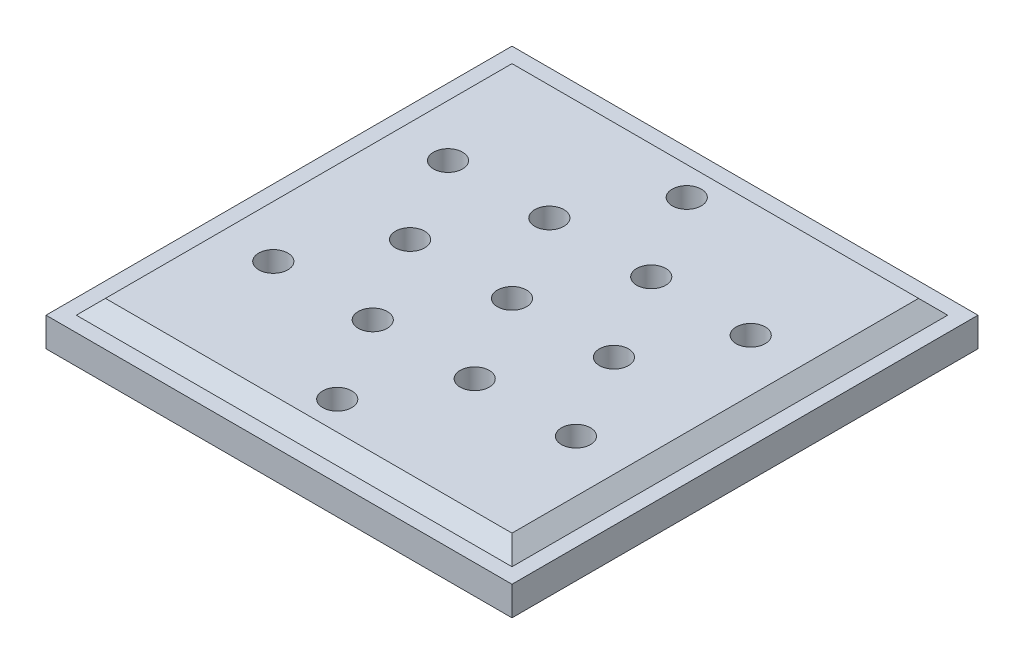
ISO-10303-21;
HEADER;
FILE_DESCRIPTION(('STEP AP214'),'2;1');
FILE_NAME('part.step','',(''),(''),'','','');
FILE_SCHEMA(('AUTOMOTIVE_DESIGN { 1 0 10303 214 1 1 1 1 }'));
ENDSEC;
DATA;
#1=APPLICATION_CONTEXT('core data for automotive mechanical design processes');
#2=APPLICATION_PROTOCOL_DEFINITION('international standard','automotive_design',2000,#1);
#3=PRODUCT_CONTEXT('',#1,'mechanical');
#4=PRODUCT('Part','Part','',(#3));
#5=PRODUCT_RELATED_PRODUCT_CATEGORY('part','',(#4));
#6=PRODUCT_DEFINITION_FORMATION('','',#4);
#7=PRODUCT_DEFINITION_CONTEXT('part definition',#1,'design');
#8=PRODUCT_DEFINITION('design','',#6,#7);
#9=PRODUCT_DEFINITION_SHAPE('','',#8);
#10=(LENGTH_UNIT() NAMED_UNIT(*) SI_UNIT(.MILLI.,.METRE.));
#11=(NAMED_UNIT(*) PLANE_ANGLE_UNIT() SI_UNIT($,.RADIAN.));
#12=(NAMED_UNIT(*) SI_UNIT($,.STERADIAN.) SOLID_ANGLE_UNIT());
#13=UNCERTAINTY_MEASURE_WITH_UNIT(LENGTH_MEASURE(1.E-05),#10,'distance_accuracy_value','');
#14=(GEOMETRIC_REPRESENTATION_CONTEXT(3) GLOBAL_UNCERTAINTY_ASSIGNED_CONTEXT((#13)) GLOBAL_UNIT_ASSIGNED_CONTEXT((#10,
#11,#12)) REPRESENTATION_CONTEXT('',''));
#15=CARTESIAN_POINT('',(0.,0.,0.));
#16=DIRECTION('',(0.,0.,1.));
#17=DIRECTION('',(1.,0.,0.));
#18=AXIS2_PLACEMENT_3D('',#15,#16,#17);
#19=CARTESIAN_POINT('',(50.8,9.525,-50.8));
#20=DIRECTION('',(-1.,0.,0.));
#21=DIRECTION('',(0.,0.,1.));
#22=AXIS2_PLACEMENT_3D('',#19,#20,#21);
#23=PLANE('',#22);
#24=DIRECTION('',(0.,0.,-1.));
#25=VECTOR('',#24,1.);
#26=CARTESIAN_POINT('',(50.8,6.35,-50.8));
#27=LINE('',#26,#25);
#28=CARTESIAN_POINT('',(50.8,6.35,50.8));
#29=VERTEX_POINT('',#28);
#30=CARTESIAN_POINT('',(50.8,6.35,-50.8));
#31=VERTEX_POINT('',#30);
#32=EDGE_CURVE('E141',#29,#31,#27,.T.);
#33=ORIENTED_EDGE('',*,*,#32,.F.);
#34=DIRECTION('',(0.,-1.,0.));
#35=VECTOR('',#34,1.);
#36=CARTESIAN_POINT('',(50.8,9.525,50.8));
#37=LINE('',#36,#35);
#38=CARTESIAN_POINT('',(50.8,0.,50.8));
#39=VERTEX_POINT('',#38);
#40=EDGE_CURVE('E155',#29,#39,#37,.T.);
#41=ORIENTED_EDGE('',*,*,#40,.T.);
#42=DIRECTION('',(0.,0.,-1.));
#43=VECTOR('',#42,1.);
#44=CARTESIAN_POINT('',(50.8,0.,-50.8));
#45=LINE('',#44,#43);
#46=CARTESIAN_POINT('',(50.8,0.,-50.8));
#47=VERTEX_POINT('',#46);
#48=EDGE_CURVE('E143',#39,#47,#45,.T.);
#49=ORIENTED_EDGE('',*,*,#48,.T.);
#50=DIRECTION('',(0.,-1.,0.));
#51=VECTOR('',#50,1.);
#52=CARTESIAN_POINT('',(50.8,9.525,-50.8));
#53=LINE('',#52,#51);
#54=EDGE_CURVE('E161',#31,#47,#53,.T.);
#55=ORIENTED_EDGE('',*,*,#54,.F.);
#56=EDGE_LOOP('',(#33,#41,#49,#55));
#57=FACE_BOUND('',#56,.T.);
#58=ADVANCED_FACE('F34',(#57),#23,.F.);
#59=CARTESIAN_POINT('',(-50.8,9.525,-50.8));
#60=DIRECTION('',(0.,0.,1.));
#61=DIRECTION('',(1.,0.,0.));
#62=AXIS2_PLACEMENT_3D('',#59,#60,#61);
#63=PLANE('',#62);
#64=DIRECTION('',(-1.,0.,0.));
#65=VECTOR('',#64,1.);
#66=CARTESIAN_POINT('',(-50.8,6.35,-50.8));
#67=LINE('',#66,#65);
#68=CARTESIAN_POINT('',(-50.8,6.35,-50.8));
#69=VERTEX_POINT('',#68);
#70=EDGE_CURVE('E139',#31,#69,#67,.T.);
#71=ORIENTED_EDGE('',*,*,#70,.F.);
#72=ORIENTED_EDGE('',*,*,#54,.T.);
#73=DIRECTION('',(-1.,0.,0.));
#74=VECTOR('',#73,1.);
#75=CARTESIAN_POINT('',(-50.8,0.,-50.8));
#76=LINE('',#75,#74);
#77=CARTESIAN_POINT('',(-50.8,0.,-50.8));
#78=VERTEX_POINT('',#77);
#79=EDGE_CURVE('E146',#47,#78,#76,.T.);
#80=ORIENTED_EDGE('',*,*,#79,.T.);
#81=DIRECTION('',(0.,-1.,0.));
#82=VECTOR('',#81,1.);
#83=CARTESIAN_POINT('',(-50.8,9.525,-50.8));
#84=LINE('',#83,#82);
#85=EDGE_CURVE('E159',#69,#78,#84,.T.);
#86=ORIENTED_EDGE('',*,*,#85,.F.);
#87=EDGE_LOOP('',(#71,#72,#80,#86));
#88=FACE_BOUND('',#87,.T.);
#89=ADVANCED_FACE('F182',(#88),#63,.F.);
#90=CARTESIAN_POINT('',(-50.8,9.525,-50.8));
#91=DIRECTION('',(1.,0.,0.));
#92=DIRECTION('',(0.,0.,-1.));
#93=AXIS2_PLACEMENT_3D('',#90,#91,#92);
#94=PLANE('',#93);
#95=DIRECTION('',(0.,0.,1.));
#96=VECTOR('',#95,1.);
#97=CARTESIAN_POINT('',(-50.8,6.35,-50.8));
#98=LINE('',#97,#96);
#99=CARTESIAN_POINT('',(-50.8,6.35,50.8));
#100=VERTEX_POINT('',#99);
#101=EDGE_CURVE('E135',#69,#100,#98,.T.);
#102=ORIENTED_EDGE('',*,*,#101,.F.);
#103=ORIENTED_EDGE('',*,*,#85,.T.);
#104=DIRECTION('',(0.,0.,1.));
#105=VECTOR('',#104,1.);
#106=CARTESIAN_POINT('',(-50.8,0.,-50.8));
#107=LINE('',#106,#105);
#108=CARTESIAN_POINT('',(-50.8,0.,50.8));
#109=VERTEX_POINT('',#108);
#110=EDGE_CURVE('E149',#78,#109,#107,.T.);
#111=ORIENTED_EDGE('',*,*,#110,.T.);
#112=DIRECTION('',(0.,-1.,0.));
#113=VECTOR('',#112,1.);
#114=CARTESIAN_POINT('',(-50.8,9.525,50.8));
#115=LINE('',#114,#113);
#116=EDGE_CURVE('E157',#100,#109,#115,.T.);
#117=ORIENTED_EDGE('',*,*,#116,.F.);
#118=EDGE_LOOP('',(#102,#103,#111,#117));
#119=FACE_BOUND('',#118,.T.);
#120=ADVANCED_FACE('F188',(#119),#94,.F.);
#121=CARTESIAN_POINT('',(-50.8,9.525,50.8));
#122=DIRECTION('',(0.,0.,-1.));
#123=DIRECTION('',(-1.,0.,0.));
#124=AXIS2_PLACEMENT_3D('',#121,#122,#123);
#125=PLANE('',#124);
#126=DIRECTION('',(1.,0.,0.));
#127=VECTOR('',#126,1.);
#128=CARTESIAN_POINT('',(-50.8,6.35,50.8));
#129=LINE('',#128,#127);
#130=EDGE_CURVE('E163',#100,#29,#129,.T.);
#131=ORIENTED_EDGE('',*,*,#130,.F.);
#132=ORIENTED_EDGE('',*,*,#116,.T.);
#133=DIRECTION('',(1.,0.,0.));
#134=VECTOR('',#133,1.);
#135=CARTESIAN_POINT('',(-50.8,0.,50.8));
#136=LINE('',#135,#134);
#137=EDGE_CURVE('E152',#109,#39,#136,.T.);
#138=ORIENTED_EDGE('',*,*,#137,.T.);
#139=ORIENTED_EDGE('',*,*,#40,.F.);
#140=EDGE_LOOP('',(#131,#132,#138,#139));
#141=FACE_BOUND('',#140,.T.);
#142=ADVANCED_FACE('F372',(#141),#125,.F.);
#143=CARTESIAN_POINT('',(0.,0.,0.));
#144=DIRECTION('',(0.,1.,0.));
#145=DIRECTION('',(0.,0.,1.));
#146=AXIS2_PLACEMENT_3D('',#143,#144,#145);
#147=PLANE('',#146);
#148=CARTESIAN_POINT('',(11.1125,0.,-19.2474145991092));
#149=DIRECTION('',(0.,1.,0.));
#150=DIRECTION('',(0.,0.,1.));
#151=AXIS2_PLACEMENT_3D('',#148,#149,#150);
#152=CIRCLE('',#151,3.175);
#153=CARTESIAN_POINT('',(11.1125,0.,-16.0724145991092));
#154=VERTEX_POINT('',#153);
#155=EDGE_CURVE('E399',#154,#154,#152,.F.);
#156=ORIENTED_EDGE('',*,*,#155,.F.);
#157=EDGE_LOOP('',(#156));
#158=FACE_BOUND('',#157,.T.);
#159=CARTESIAN_POINT('',(-11.1125,0.,-19.2474145991091));
#160=DIRECTION('',(0.,1.,0.));
#161=DIRECTION('',(0.,0.,1.));
#162=AXIS2_PLACEMENT_3D('',#159,#160,#161);
#163=CIRCLE('',#162,3.175);
#164=CARTESIAN_POINT('',(-11.1125,0.,-16.0724145991091));
#165=VERTEX_POINT('',#164);
#166=EDGE_CURVE('E403',#165,#165,#163,.F.);
#167=ORIENTED_EDGE('',*,*,#166,.F.);
#168=EDGE_LOOP('',(#167));
#169=FACE_BOUND('',#168,.T.);
#170=CARTESIAN_POINT('',(-22.225,0.,0.));
#171=DIRECTION('',(0.,1.,0.));
#172=DIRECTION('',(0.,0.,1.));
#173=AXIS2_PLACEMENT_3D('',#170,#171,#172);
#174=CIRCLE('',#173,3.175);
#175=CARTESIAN_POINT('',(-22.225,0.,3.175));
#176=VERTEX_POINT('',#175);
#177=EDGE_CURVE('E407',#176,#176,#174,.F.);
#178=ORIENTED_EDGE('',*,*,#177,.F.);
#179=EDGE_LOOP('',(#178));
#180=FACE_BOUND('',#179,.T.);
#181=CARTESIAN_POINT('',(-11.1125,0.,19.2474145991092));
#182=DIRECTION('',(0.,1.,0.));
#183=DIRECTION('',(0.,0.,1.));
#184=AXIS2_PLACEMENT_3D('',#181,#182,#183);
#185=CIRCLE('',#184,3.175);
#186=CARTESIAN_POINT('',(-11.1125,0.,22.4224145991092));
#187=VERTEX_POINT('',#186);
#188=EDGE_CURVE('E411',#187,#187,#185,.F.);
#189=ORIENTED_EDGE('',*,*,#188,.F.);
#190=EDGE_LOOP('',(#189));
#191=FACE_BOUND('',#190,.T.);
#192=CARTESIAN_POINT('',(11.1125,0.,19.2474145991092));
#193=DIRECTION('',(0.,1.,0.));
#194=DIRECTION('',(0.,0.,1.));
#195=AXIS2_PLACEMENT_3D('',#192,#193,#194);
#196=CIRCLE('',#195,3.175);
#197=CARTESIAN_POINT('',(11.1125,0.,22.4224145991092));
#198=VERTEX_POINT('',#197);
#199=EDGE_CURVE('E415',#198,#198,#196,.F.);
#200=ORIENTED_EDGE('',*,*,#199,.F.);
#201=EDGE_LOOP('',(#200));
#202=FACE_BOUND('',#201,.T.);
#203=CARTESIAN_POINT('',(0.,0.,0.));
#204=DIRECTION('',(0.,1.,0.));
#205=DIRECTION('',(0.,0.,1.));
#206=AXIS2_PLACEMENT_3D('',#203,#204,#205);
#207=CIRCLE('',#206,3.175);
#208=CARTESIAN_POINT('',(0.,0.,3.17500000000001));
#209=VERTEX_POINT('',#208);
#210=EDGE_CURVE('E419',#209,#209,#207,.F.);
#211=ORIENTED_EDGE('',*,*,#210,.F.);
#212=EDGE_LOOP('',(#211));
#213=FACE_BOUND('',#212,.T.);
#214=CARTESIAN_POINT('',(-32.9955678841871,0.,-19.05));
#215=DIRECTION('',(0.,1.,0.));
#216=DIRECTION('',(0.,0.,1.));
#217=AXIS2_PLACEMENT_3D('',#214,#215,#216);
#218=CIRCLE('',#217,3.17500000000044);
#219=CARTESIAN_POINT('',(-32.9955678841871,0.,-15.8749999999996));
#220=VERTEX_POINT('',#219);
#221=EDGE_CURVE('E423',#220,#220,#218,.F.);
#222=ORIENTED_EDGE('',*,*,#221,.F.);
#223=EDGE_LOOP('',(#222));
#224=FACE_BOUND('',#223,.T.);
#225=CARTESIAN_POINT('',(-32.9955678841871,0.,19.05));
#226=DIRECTION('',(0.,1.,0.));
#227=DIRECTION('',(0.,0.,1.));
#228=AXIS2_PLACEMENT_3D('',#225,#226,#227);
#229=CIRCLE('',#228,3.17500000000033);
#230=CARTESIAN_POINT('',(-32.9955678841871,0.,22.2250000000003));
#231=VERTEX_POINT('',#230);
#232=EDGE_CURVE('E427',#231,#231,#229,.F.);
#233=ORIENTED_EDGE('',*,*,#232,.F.);
#234=EDGE_LOOP('',(#233));
#235=FACE_BOUND('',#234,.T.);
#236=CARTESIAN_POINT('',(0.,0.,38.1));
#237=DIRECTION('',(0.,1.,0.));
#238=DIRECTION('',(0.,0.,1.));
#239=AXIS2_PLACEMENT_3D('',#236,#237,#238);
#240=CIRCLE('',#239,3.17500000000023);
#241=CARTESIAN_POINT('',(0.,0.,41.2750000000002));
#242=VERTEX_POINT('',#241);
#243=EDGE_CURVE('E431',#242,#242,#240,.F.);
#244=ORIENTED_EDGE('',*,*,#243,.F.);
#245=EDGE_LOOP('',(#244));
#246=FACE_BOUND('',#245,.T.);
#247=CARTESIAN_POINT('',(32.9955678841871,0.,19.05));
#248=DIRECTION('',(0.,1.,0.));
#249=DIRECTION('',(0.,0.,1.));
#250=AXIS2_PLACEMENT_3D('',#247,#248,#249);
#251=CIRCLE('',#250,3.17500000000017);
#252=CARTESIAN_POINT('',(32.9955678841871,0.,22.2250000000002));
#253=VERTEX_POINT('',#252);
#254=EDGE_CURVE('E435',#253,#253,#251,.F.);
#255=ORIENTED_EDGE('',*,*,#254,.F.);
#256=EDGE_LOOP('',(#255));
#257=FACE_BOUND('',#256,.T.);
#258=CARTESIAN_POINT('',(32.9955678841871,0.,-19.05));
#259=DIRECTION('',(0.,1.,0.));
#260=DIRECTION('',(0.,0.,1.));
#261=AXIS2_PLACEMENT_3D('',#258,#259,#260);
#262=CIRCLE('',#261,3.17500000000009);
#263=CARTESIAN_POINT('',(32.9955678841871,0.,-15.8749999999999));
#264=VERTEX_POINT('',#263);
#265=EDGE_CURVE('E439',#264,#264,#262,.F.);
#266=ORIENTED_EDGE('',*,*,#265,.F.);
#267=EDGE_LOOP('',(#266));
#268=FACE_BOUND('',#267,.T.);
#269=CARTESIAN_POINT('',(22.225,0.,0.));
#270=DIRECTION('',(0.,1.,0.));
#271=DIRECTION('',(0.,0.,1.));
#272=AXIS2_PLACEMENT_3D('',#269,#270,#271);
#273=CIRCLE('',#272,3.175);
#274=CARTESIAN_POINT('',(22.225,0.,3.17500000000001));
#275=VERTEX_POINT('',#274);
#276=EDGE_CURVE('E443',#275,#275,#273,.F.);
#277=ORIENTED_EDGE('',*,*,#276,.F.);
#278=EDGE_LOOP('',(#277));
#279=FACE_BOUND('',#278,.T.);
#280=CARTESIAN_POINT('',(0.,0.,-38.1));
#281=DIRECTION('',(0.,1.,0.));
#282=DIRECTION('',(0.,0.,1.));
#283=AXIS2_PLACEMENT_3D('',#280,#281,#282);
#284=CIRCLE('',#283,3.175);
#285=CARTESIAN_POINT('',(0.,0.,-34.925));
#286=VERTEX_POINT('',#285);
#287=EDGE_CURVE('E117',#286,#286,#284,.F.);
#288=ORIENTED_EDGE('',*,*,#287,.F.);
#289=EDGE_LOOP('',(#288));
#290=FACE_BOUND('',#289,.T.);
#291=ORIENTED_EDGE('',*,*,#48,.F.);
#292=ORIENTED_EDGE('',*,*,#137,.F.);
#293=ORIENTED_EDGE('',*,*,#110,.F.);
#294=ORIENTED_EDGE('',*,*,#79,.F.);
#295=EDGE_LOOP('',(#291,#292,#293,#294));
#296=FACE_BOUND('',#295,.T.);
#297=ADVANCED_FACE('F176',(#158,#169,#180,#191,#202,#213,#224,#235,#246,#257,#268,#279,#290,
#296),#147,.F.);
#298=CARTESIAN_POINT('',(0.,6.35,0.));
#299=DIRECTION('',(0.,1.,0.));
#300=DIRECTION('',(0.,0.,1.));
#301=AXIS2_PLACEMENT_3D('',#298,#299,#300);
#302=PLANE('',#301);
#303=DIRECTION('',(1.,0.,0.));
#304=VECTOR('',#303,1.);
#305=CARTESIAN_POINT('',(-47.498,6.35,47.498));
#306=LINE('',#305,#304);
#307=CARTESIAN_POINT('',(-47.498,6.35,47.498));
#308=VERTEX_POINT('',#307);
#309=CARTESIAN_POINT('',(47.498,6.35,47.498));
#310=VERTEX_POINT('',#309);
#311=EDGE_CURVE('E130',#308,#310,#306,.T.);
#312=ORIENTED_EDGE('',*,*,#311,.F.);
#313=DIRECTION('',(0.,0.,1.));
#314=VECTOR('',#313,1.);
#315=CARTESIAN_POINT('',(-47.498,6.35,-47.498));
#316=LINE('',#315,#314);
#317=CARTESIAN_POINT('',(-47.498,6.35,-47.498));
#318=VERTEX_POINT('',#317);
#319=EDGE_CURVE('E106',#318,#308,#316,.T.);
#320=ORIENTED_EDGE('',*,*,#319,.F.);
#321=DIRECTION('',(-1.,0.,0.));
#322=VECTOR('',#321,1.);
#323=CARTESIAN_POINT('',(-47.498,6.35,-47.498));
#324=LINE('',#323,#322);
#325=CARTESIAN_POINT('',(47.498,6.35,-47.498));
#326=VERTEX_POINT('',#325);
#327=EDGE_CURVE('E101',#326,#318,#324,.T.);
#328=ORIENTED_EDGE('',*,*,#327,.F.);
#329=DIRECTION('',(0.,0.,-1.));
#330=VECTOR('',#329,1.);
#331=CARTESIAN_POINT('',(47.498,6.35,-47.498));
#332=LINE('',#331,#330);
#333=EDGE_CURVE('E104',#310,#326,#332,.T.);
#334=ORIENTED_EDGE('',*,*,#333,.F.);
#335=EDGE_LOOP('',(#312,#320,#328,#334));
#336=FACE_BOUND('',#335,.T.);
#337=ORIENTED_EDGE('',*,*,#32,.T.);
#338=ORIENTED_EDGE('',*,*,#70,.T.);
#339=ORIENTED_EDGE('',*,*,#101,.T.);
#340=ORIENTED_EDGE('',*,*,#130,.T.);
#341=EDGE_LOOP('',(#337,#338,#339,#340));
#342=FACE_BOUND('',#341,.T.);
#343=ADVANCED_FACE('F102',(#336,#342),#302,.T.);
#344=CARTESIAN_POINT('',(0.,9.525,0.));
#345=DIRECTION('',(0.,1.,0.));
#346=DIRECTION('',(0.,0.,1.));
#347=AXIS2_PLACEMENT_3D('',#344,#345,#346);
#348=PLANE('',#347);
#349=CARTESIAN_POINT('',(11.1125,9.525,-19.2474145991092));
#350=DIRECTION('',(0.,1.,0.));
#351=DIRECTION('',(0.,0.,1.));
#352=AXIS2_PLACEMENT_3D('',#349,#350,#351);
#353=CIRCLE('',#352,3.175);
#354=CARTESIAN_POINT('',(11.1125,9.525,-16.0724145991092));
#355=VERTEX_POINT('',#354);
#356=EDGE_CURVE('E507',#355,#355,#353,.T.);
#357=ORIENTED_EDGE('',*,*,#356,.F.);
#358=EDGE_LOOP('',(#357));
#359=FACE_BOUND('',#358,.T.);
#360=CARTESIAN_POINT('',(-11.1125,9.525,-19.2474145991091));
#361=DIRECTION('',(0.,1.,0.));
#362=DIRECTION('',(0.,0.,1.));
#363=AXIS2_PLACEMENT_3D('',#360,#361,#362);
#364=CIRCLE('',#363,3.175);
#365=CARTESIAN_POINT('',(-11.1125,9.525,-16.0724145991091));
#366=VERTEX_POINT('',#365);
#367=EDGE_CURVE('E503',#366,#366,#364,.T.);
#368=ORIENTED_EDGE('',*,*,#367,.F.);
#369=EDGE_LOOP('',(#368));
#370=FACE_BOUND('',#369,.T.);
#371=CARTESIAN_POINT('',(-22.225,9.525,0.));
#372=DIRECTION('',(0.,1.,0.));
#373=DIRECTION('',(0.,0.,1.));
#374=AXIS2_PLACEMENT_3D('',#371,#372,#373);
#375=CIRCLE('',#374,3.175);
#376=CARTESIAN_POINT('',(-22.225,9.525,3.175));
#377=VERTEX_POINT('',#376);
#378=EDGE_CURVE('E499',#377,#377,#375,.T.);
#379=ORIENTED_EDGE('',*,*,#378,.F.);
#380=EDGE_LOOP('',(#379));
#381=FACE_BOUND('',#380,.T.);
#382=CARTESIAN_POINT('',(-11.1125,9.525,19.2474145991092));
#383=DIRECTION('',(0.,1.,0.));
#384=DIRECTION('',(0.,0.,1.));
#385=AXIS2_PLACEMENT_3D('',#382,#383,#384);
#386=CIRCLE('',#385,3.175);
#387=CARTESIAN_POINT('',(-11.1125,9.525,22.4224145991092));
#388=VERTEX_POINT('',#387);
#389=EDGE_CURVE('E495',#388,#388,#386,.T.);
#390=ORIENTED_EDGE('',*,*,#389,.F.);
#391=EDGE_LOOP('',(#390));
#392=FACE_BOUND('',#391,.T.);
#393=CARTESIAN_POINT('',(11.1125,9.525,19.2474145991092));
#394=DIRECTION('',(0.,1.,0.));
#395=DIRECTION('',(0.,0.,1.));
#396=AXIS2_PLACEMENT_3D('',#393,#394,#395);
#397=CIRCLE('',#396,3.175);
#398=CARTESIAN_POINT('',(11.1125,9.525,22.4224145991092));
#399=VERTEX_POINT('',#398);
#400=EDGE_CURVE('E491',#399,#399,#397,.T.);
#401=ORIENTED_EDGE('',*,*,#400,.F.);
#402=EDGE_LOOP('',(#401));
#403=FACE_BOUND('',#402,.T.);
#404=CARTESIAN_POINT('',(0.,9.525,0.));
#405=DIRECTION('',(0.,1.,0.));
#406=DIRECTION('',(0.,0.,1.));
#407=AXIS2_PLACEMENT_3D('',#404,#405,#406);
#408=CIRCLE('',#407,3.175);
#409=CARTESIAN_POINT('',(0.,9.525,3.17500000000001));
#410=VERTEX_POINT('',#409);
#411=EDGE_CURVE('E487',#410,#410,#408,.T.);
#412=ORIENTED_EDGE('',*,*,#411,.F.);
#413=EDGE_LOOP('',(#412));
#414=FACE_BOUND('',#413,.T.);
#415=CARTESIAN_POINT('',(-32.9955678841871,9.525,-19.05));
#416=DIRECTION('',(0.,1.,0.));
#417=DIRECTION('',(0.,0.,1.));
#418=AXIS2_PLACEMENT_3D('',#415,#416,#417);
#419=CIRCLE('',#418,3.17500000000044);
#420=CARTESIAN_POINT('',(-32.9955678841871,9.525,-15.8749999999996));
#421=VERTEX_POINT('',#420);
#422=EDGE_CURVE('E483',#421,#421,#419,.T.);
#423=ORIENTED_EDGE('',*,*,#422,.F.);
#424=EDGE_LOOP('',(#423));
#425=FACE_BOUND('',#424,.T.);
#426=CARTESIAN_POINT('',(-32.9955678841871,9.525,19.05));
#427=DIRECTION('',(0.,1.,0.));
#428=DIRECTION('',(0.,0.,1.));
#429=AXIS2_PLACEMENT_3D('',#426,#427,#428);
#430=CIRCLE('',#429,3.17500000000033);
#431=CARTESIAN_POINT('',(-32.9955678841871,9.525,22.2250000000003));
#432=VERTEX_POINT('',#431);
#433=EDGE_CURVE('E479',#432,#432,#430,.T.);
#434=ORIENTED_EDGE('',*,*,#433,.F.);
#435=EDGE_LOOP('',(#434));
#436=FACE_BOUND('',#435,.T.);
#437=CARTESIAN_POINT('',(0.,9.525,38.1));
#438=DIRECTION('',(0.,1.,0.));
#439=DIRECTION('',(0.,0.,1.));
#440=AXIS2_PLACEMENT_3D('',#437,#438,#439);
#441=CIRCLE('',#440,3.17500000000023);
#442=CARTESIAN_POINT('',(0.,9.525,41.2750000000002));
#443=VERTEX_POINT('',#442);
#444=EDGE_CURVE('E475',#443,#443,#441,.T.);
#445=ORIENTED_EDGE('',*,*,#444,.F.);
#446=EDGE_LOOP('',(#445));
#447=FACE_BOUND('',#446,.T.);
#448=CARTESIAN_POINT('',(32.9955678841871,9.525,19.05));
#449=DIRECTION('',(0.,1.,0.));
#450=DIRECTION('',(0.,0.,1.));
#451=AXIS2_PLACEMENT_3D('',#448,#449,#450);
#452=CIRCLE('',#451,3.17500000000017);
#453=CARTESIAN_POINT('',(32.9955678841871,9.525,22.2250000000002));
#454=VERTEX_POINT('',#453);
#455=EDGE_CURVE('E471',#454,#454,#452,.T.);
#456=ORIENTED_EDGE('',*,*,#455,.F.);
#457=EDGE_LOOP('',(#456));
#458=FACE_BOUND('',#457,.T.);
#459=CARTESIAN_POINT('',(32.9955678841871,9.525,-19.05));
#460=DIRECTION('',(0.,1.,0.));
#461=DIRECTION('',(0.,0.,1.));
#462=AXIS2_PLACEMENT_3D('',#459,#460,#461);
#463=CIRCLE('',#462,3.17500000000009);
#464=CARTESIAN_POINT('',(32.9955678841871,9.525,-15.8749999999999));
#465=VERTEX_POINT('',#464);
#466=EDGE_CURVE('E467',#465,#465,#463,.T.);
#467=ORIENTED_EDGE('',*,*,#466,.F.);
#468=EDGE_LOOP('',(#467));
#469=FACE_BOUND('',#468,.T.);
#470=CARTESIAN_POINT('',(22.225,9.525,0.));
#471=DIRECTION('',(0.,1.,0.));
#472=DIRECTION('',(0.,0.,1.));
#473=AXIS2_PLACEMENT_3D('',#470,#471,#472);
#474=CIRCLE('',#473,3.175);
#475=CARTESIAN_POINT('',(22.225,9.525,3.17500000000001));
#476=VERTEX_POINT('',#475);
#477=EDGE_CURVE('E459',#476,#476,#474,.T.);
#478=ORIENTED_EDGE('',*,*,#477,.F.);
#479=EDGE_LOOP('',(#478));
#480=FACE_BOUND('',#479,.T.);
#481=CARTESIAN_POINT('',(0.,9.525,-38.1));
#482=DIRECTION('',(0.,1.,0.));
#483=DIRECTION('',(0.,0.,1.));
#484=AXIS2_PLACEMENT_3D('',#481,#482,#483);
#485=CIRCLE('',#484,3.175);
#486=CARTESIAN_POINT('',(0.,9.525,-34.925));
#487=VERTEX_POINT('',#486);
#488=EDGE_CURVE('E122',#487,#487,#485,.T.);
#489=ORIENTED_EDGE('',*,*,#488,.F.);
#490=EDGE_LOOP('',(#489));
#491=FACE_BOUND('',#490,.T.);
#492=DIRECTION('',(1.,0.,0.));
#493=VECTOR('',#492,1.);
#494=CARTESIAN_POINT('',(0.,9.525,44.323));
#495=LINE('',#494,#493);
#496=CARTESIAN_POINT('',(-44.323,9.525,44.323));
#497=VERTEX_POINT('',#496);
#498=CARTESIAN_POINT('',(44.323,9.525,44.323));
#499=VERTEX_POINT('',#498);
#500=EDGE_CURVE('E131',#497,#499,#495,.T.);
#501=ORIENTED_EDGE('',*,*,#500,.T.);
#502=DIRECTION('',(0.,0.,-1.));
#503=VECTOR('',#502,1.);
#504=CARTESIAN_POINT('',(44.323,9.525,0.));
#505=LINE('',#504,#503);
#506=CARTESIAN_POINT('',(44.323,9.525,-44.323));
#507=VERTEX_POINT('',#506);
#508=EDGE_CURVE('E12',#499,#507,#505,.T.);
#509=ORIENTED_EDGE('',*,*,#508,.T.);
#510=DIRECTION('',(-1.,0.,0.));
#511=VECTOR('',#510,1.);
#512=CARTESIAN_POINT('',(0.,9.525,-44.323));
#513=LINE('',#512,#511);
#514=CARTESIAN_POINT('',(-44.323,9.525,-44.323));
#515=VERTEX_POINT('',#514);
#516=EDGE_CURVE('E43',#507,#515,#513,.T.);
#517=ORIENTED_EDGE('',*,*,#516,.T.);
#518=DIRECTION('',(0.,0.,1.));
#519=VECTOR('',#518,1.);
#520=CARTESIAN_POINT('',(-44.323,9.525,0.));
#521=LINE('',#520,#519);
#522=EDGE_CURVE('E133',#515,#497,#521,.T.);
#523=ORIENTED_EDGE('',*,*,#522,.T.);
#524=EDGE_LOOP('',(#501,#509,#517,#523));
#525=FACE_BOUND('',#524,.T.);
#526=ADVANCED_FACE('F166',(#359,#370,#381,#392,#403,#414,#425,#436,#447,#458,#469,#480,#491,
#525),#348,.T.);
#527=CARTESIAN_POINT('',(-44.323,9.525,0.));
#528=DIRECTION('',(0.707106781186549,-0.707106781186546,0.));
#529=DIRECTION('',(0.,0.,1.));
#530=AXIS2_PLACEMENT_3D('',#527,#528,#529);
#531=PLANE('',#530);
#532=DIRECTION('',(-0.577350269189625,-0.577350269189627,-0.577350269189625));
#533=VECTOR('',#532,1.);
#534=CARTESIAN_POINT('',(-29.5486666666667,24.2993333333333,-29.5486666666667));
#535=LINE('',#534,#533);
#536=EDGE_CURVE('E119',#318,#515,#535,.F.);
#537=ORIENTED_EDGE('',*,*,#536,.F.);
#538=ORIENTED_EDGE('',*,*,#319,.T.);
#539=DIRECTION('',(-0.577350269189625,-0.577350269189627,0.577350269189625));
#540=VECTOR('',#539,1.);
#541=CARTESIAN_POINT('',(-29.5486666666667,24.2993333333334,29.5486666666667));
#542=LINE('',#541,#540);
#543=EDGE_CURVE('E38',#497,#308,#542,.T.);
#544=ORIENTED_EDGE('',*,*,#543,.F.);
#545=ORIENTED_EDGE('',*,*,#522,.F.);
#546=EDGE_LOOP('',(#537,#538,#544,#545));
#547=FACE_BOUND('',#546,.T.);
#548=ADVANCED_FACE('F36',(#547),#531,.F.);
#549=CARTESIAN_POINT('',(0.,9.525,44.323));
#550=DIRECTION('',(0.,-0.707106781186546,-0.707106781186549));
#551=DIRECTION('',(1.,0.,0.));
#552=AXIS2_PLACEMENT_3D('',#549,#550,#551);
#553=PLANE('',#552);
#554=ORIENTED_EDGE('',*,*,#543,.T.);
#555=ORIENTED_EDGE('',*,*,#311,.T.);
#556=DIRECTION('',(-0.577350269189625,0.577350269189627,-0.577350269189625));
#557=VECTOR('',#556,1.);
#558=CARTESIAN_POINT('',(29.5486666666667,24.2993333333334,29.5486666666667));
#559=LINE('',#558,#557);
#560=EDGE_CURVE('E113',#499,#310,#559,.F.);
#561=ORIENTED_EDGE('',*,*,#560,.F.);
#562=ORIENTED_EDGE('',*,*,#500,.F.);
#563=EDGE_LOOP('',(#554,#555,#561,#562));
#564=FACE_BOUND('',#563,.T.);
#565=ADVANCED_FACE('F129',(#564),#553,.F.);
#566=CARTESIAN_POINT('',(0.,9.525,-44.323));
#567=DIRECTION('',(0.,-0.707106781186546,0.707106781186549));
#568=DIRECTION('',(-1.,0.,0.));
#569=AXIS2_PLACEMENT_3D('',#566,#567,#568);
#570=PLANE('',#569);
#571=ORIENTED_EDGE('',*,*,#536,.T.);
#572=ORIENTED_EDGE('',*,*,#516,.F.);
#573=DIRECTION('',(0.577350269189625,-0.577350269189627,-0.577350269189625));
#574=VECTOR('',#573,1.);
#575=CARTESIAN_POINT('',(29.5486666666667,24.2993333333334,-29.5486666666667));
#576=LINE('',#575,#574);
#577=EDGE_CURVE('E51',#326,#507,#576,.F.);
#578=ORIENTED_EDGE('',*,*,#577,.F.);
#579=ORIENTED_EDGE('',*,*,#327,.T.);
#580=EDGE_LOOP('',(#571,#572,#578,#579));
#581=FACE_BOUND('',#580,.T.);
#582=ADVANCED_FACE('F116',(#581),#570,.F.);
#583=CARTESIAN_POINT('',(44.323,9.525,0.));
#584=DIRECTION('',(-0.707106781186549,-0.707106781186546,0.));
#585=DIRECTION('',(0.,0.,-1.));
#586=AXIS2_PLACEMENT_3D('',#583,#584,#585);
#587=PLANE('',#586);
#588=ORIENTED_EDGE('',*,*,#560,.T.);
#589=ORIENTED_EDGE('',*,*,#333,.T.);
#590=ORIENTED_EDGE('',*,*,#577,.T.);
#591=ORIENTED_EDGE('',*,*,#508,.F.);
#592=EDGE_LOOP('',(#588,#589,#590,#591));
#593=FACE_BOUND('',#592,.T.);
#594=ADVANCED_FACE('F111',(#593),#587,.F.);
#595=CARTESIAN_POINT('',(0.,-0.000999999999999265,-38.1));
#596=DIRECTION('',(0.,1.,0.));
#597=DIRECTION('',(0.,0.,1.));
#598=AXIS2_PLACEMENT_3D('',#595,#596,#597);
#599=CYLINDRICAL_SURFACE('',#598,3.175);
#600=ORIENTED_EDGE('',*,*,#488,.T.);
#601=EDGE_LOOP('',(#600));
#602=FACE_BOUND('',#601,.T.);
#603=ORIENTED_EDGE('',*,*,#287,.T.);
#604=EDGE_LOOP('',(#603));
#605=FACE_BOUND('',#604,.T.);
#606=ADVANCED_FACE('F196',(#602,#605),#599,.F.);
#607=CARTESIAN_POINT('',(22.225,-0.000999999999999265,0.));
#608=DIRECTION('',(0.,1.,0.));
#609=DIRECTION('',(0.,0.,1.));
#610=AXIS2_PLACEMENT_3D('',#607,#608,#609);
#611=CYLINDRICAL_SURFACE('',#610,3.175);
#612=ORIENTED_EDGE('',*,*,#477,.T.);
#613=EDGE_LOOP('',(#612));
#614=FACE_BOUND('',#613,.T.);
#615=ORIENTED_EDGE('',*,*,#276,.T.);
#616=EDGE_LOOP('',(#615));
#617=FACE_BOUND('',#616,.T.);
#618=ADVANCED_FACE('F216',(#614,#617),#611,.F.);
#619=CARTESIAN_POINT('',(32.9955678841871,-0.000999999999999265,-19.05));
#620=DIRECTION('',(0.,1.,0.));
#621=DIRECTION('',(0.,0.,1.));
#622=AXIS2_PLACEMENT_3D('',#619,#620,#621);
#623=CYLINDRICAL_SURFACE('',#622,3.17500000000009);
#624=ORIENTED_EDGE('',*,*,#466,.T.);
#625=EDGE_LOOP('',(#624));
#626=FACE_BOUND('',#625,.T.);
#627=ORIENTED_EDGE('',*,*,#265,.T.);
#628=EDGE_LOOP('',(#627));
#629=FACE_BOUND('',#628,.T.);
#630=ADVANCED_FACE('F224',(#626,#629),#623,.F.);
#631=CARTESIAN_POINT('',(32.9955678841871,-0.000999999999999265,19.05));
#632=DIRECTION('',(0.,1.,0.));
#633=DIRECTION('',(0.,0.,1.));
#634=AXIS2_PLACEMENT_3D('',#631,#632,#633);
#635=CYLINDRICAL_SURFACE('',#634,3.17500000000017);
#636=ORIENTED_EDGE('',*,*,#455,.T.);
#637=EDGE_LOOP('',(#636));
#638=FACE_BOUND('',#637,.T.);
#639=ORIENTED_EDGE('',*,*,#254,.T.);
#640=EDGE_LOOP('',(#639));
#641=FACE_BOUND('',#640,.T.);
#642=ADVANCED_FACE('F232',(#638,#641),#635,.F.);
#643=CARTESIAN_POINT('',(0.,-0.000999999999999265,38.1));
#644=DIRECTION('',(0.,1.,0.));
#645=DIRECTION('',(0.,0.,1.));
#646=AXIS2_PLACEMENT_3D('',#643,#644,#645);
#647=CYLINDRICAL_SURFACE('',#646,3.17500000000023);
#648=ORIENTED_EDGE('',*,*,#444,.T.);
#649=EDGE_LOOP('',(#648));
#650=FACE_BOUND('',#649,.T.);
#651=ORIENTED_EDGE('',*,*,#243,.T.);
#652=EDGE_LOOP('',(#651));
#653=FACE_BOUND('',#652,.T.);
#654=ADVANCED_FACE('F240',(#650,#653),#647,.F.);
#655=CARTESIAN_POINT('',(-32.9955678841871,-0.000999999999999265,19.05));
#656=DIRECTION('',(0.,1.,0.));
#657=DIRECTION('',(0.,0.,1.));
#658=AXIS2_PLACEMENT_3D('',#655,#656,#657);
#659=CYLINDRICAL_SURFACE('',#658,3.17500000000033);
#660=ORIENTED_EDGE('',*,*,#433,.T.);
#661=EDGE_LOOP('',(#660));
#662=FACE_BOUND('',#661,.T.);
#663=ORIENTED_EDGE('',*,*,#232,.T.);
#664=EDGE_LOOP('',(#663));
#665=FACE_BOUND('',#664,.T.);
#666=ADVANCED_FACE('F248',(#662,#665),#659,.F.);
#667=CARTESIAN_POINT('',(-32.9955678841871,-0.000999999999999265,-19.05));
#668=DIRECTION('',(0.,1.,0.));
#669=DIRECTION('',(0.,0.,1.));
#670=AXIS2_PLACEMENT_3D('',#667,#668,#669);
#671=CYLINDRICAL_SURFACE('',#670,3.17500000000044);
#672=ORIENTED_EDGE('',*,*,#422,.T.);
#673=EDGE_LOOP('',(#672));
#674=FACE_BOUND('',#673,.T.);
#675=ORIENTED_EDGE('',*,*,#221,.T.);
#676=EDGE_LOOP('',(#675));
#677=FACE_BOUND('',#676,.T.);
#678=ADVANCED_FACE('F256',(#674,#677),#671,.F.);
#679=CARTESIAN_POINT('',(0.,-0.000999999999999265,0.));
#680=DIRECTION('',(0.,1.,0.));
#681=DIRECTION('',(0.,0.,1.));
#682=AXIS2_PLACEMENT_3D('',#679,#680,#681);
#683=CYLINDRICAL_SURFACE('',#682,3.175);
#684=ORIENTED_EDGE('',*,*,#411,.T.);
#685=EDGE_LOOP('',(#684));
#686=FACE_BOUND('',#685,.T.);
#687=ORIENTED_EDGE('',*,*,#210,.T.);
#688=EDGE_LOOP('',(#687));
#689=FACE_BOUND('',#688,.T.);
#690=ADVANCED_FACE('F264',(#686,#689),#683,.F.);
#691=CARTESIAN_POINT('',(11.1125,-0.000999999999999265,19.2474145991092));
#692=DIRECTION('',(0.,1.,0.));
#693=DIRECTION('',(0.,0.,1.));
#694=AXIS2_PLACEMENT_3D('',#691,#692,#693);
#695=CYLINDRICAL_SURFACE('',#694,3.175);
#696=ORIENTED_EDGE('',*,*,#400,.T.);
#697=EDGE_LOOP('',(#696));
#698=FACE_BOUND('',#697,.T.);
#699=ORIENTED_EDGE('',*,*,#199,.T.);
#700=EDGE_LOOP('',(#699));
#701=FACE_BOUND('',#700,.T.);
#702=ADVANCED_FACE('F272',(#698,#701),#695,.F.);
#703=CARTESIAN_POINT('',(-11.1125,-0.000999999999999265,19.2474145991092));
#704=DIRECTION('',(0.,1.,0.));
#705=DIRECTION('',(0.,0.,1.));
#706=AXIS2_PLACEMENT_3D('',#703,#704,#705);
#707=CYLINDRICAL_SURFACE('',#706,3.175);
#708=ORIENTED_EDGE('',*,*,#389,.T.);
#709=EDGE_LOOP('',(#708));
#710=FACE_BOUND('',#709,.T.);
#711=ORIENTED_EDGE('',*,*,#188,.T.);
#712=EDGE_LOOP('',(#711));
#713=FACE_BOUND('',#712,.T.);
#714=ADVANCED_FACE('F280',(#710,#713),#707,.F.);
#715=CARTESIAN_POINT('',(-22.225,-0.000999999999999265,0.));
#716=DIRECTION('',(0.,1.,0.));
#717=DIRECTION('',(0.,0.,1.));
#718=AXIS2_PLACEMENT_3D('',#715,#716,#717);
#719=CYLINDRICAL_SURFACE('',#718,3.175);
#720=ORIENTED_EDGE('',*,*,#378,.T.);
#721=EDGE_LOOP('',(#720));
#722=FACE_BOUND('',#721,.T.);
#723=ORIENTED_EDGE('',*,*,#177,.T.);
#724=EDGE_LOOP('',(#723));
#725=FACE_BOUND('',#724,.T.);
#726=ADVANCED_FACE('F288',(#722,#725),#719,.F.);
#727=CARTESIAN_POINT('',(-11.1125,-0.000999999999999265,-19.2474145991091));
#728=DIRECTION('',(0.,1.,0.));
#729=DIRECTION('',(0.,0.,1.));
#730=AXIS2_PLACEMENT_3D('',#727,#728,#729);
#731=CYLINDRICAL_SURFACE('',#730,3.175);
#732=ORIENTED_EDGE('',*,*,#367,.T.);
#733=EDGE_LOOP('',(#732));
#734=FACE_BOUND('',#733,.T.);
#735=ORIENTED_EDGE('',*,*,#166,.T.);
#736=EDGE_LOOP('',(#735));
#737=FACE_BOUND('',#736,.T.);
#738=ADVANCED_FACE('F296',(#734,#737),#731,.F.);
#739=CARTESIAN_POINT('',(11.1125,-0.000999999999999265,-19.2474145991092));
#740=DIRECTION('',(0.,1.,0.));
#741=DIRECTION('',(0.,0.,1.));
#742=AXIS2_PLACEMENT_3D('',#739,#740,#741);
#743=CYLINDRICAL_SURFACE('',#742,3.175);
#744=ORIENTED_EDGE('',*,*,#356,.T.);
#745=EDGE_LOOP('',(#744));
#746=FACE_BOUND('',#745,.T.);
#747=ORIENTED_EDGE('',*,*,#155,.T.);
#748=EDGE_LOOP('',(#747));
#749=FACE_BOUND('',#748,.T.);
#750=ADVANCED_FACE('F304',(#746,#749),#743,.F.);
#751=CLOSED_SHELL('',(#58,#89,#120,#142,#297,#343,#526,#548,#565,#582,#594,#606,#618,#630,#642,
#654,#666,#678,#690,#702,#714,#726,#738,#750));
#752=MANIFOLD_SOLID_BREP('B2',#751);
#753=ADVANCED_BREP_SHAPE_REPRESENTATION('',(#18,#752),#14);
#754=SHAPE_DEFINITION_REPRESENTATION(#9,#753);
ENDSEC;
END-ISO-10303-21;
